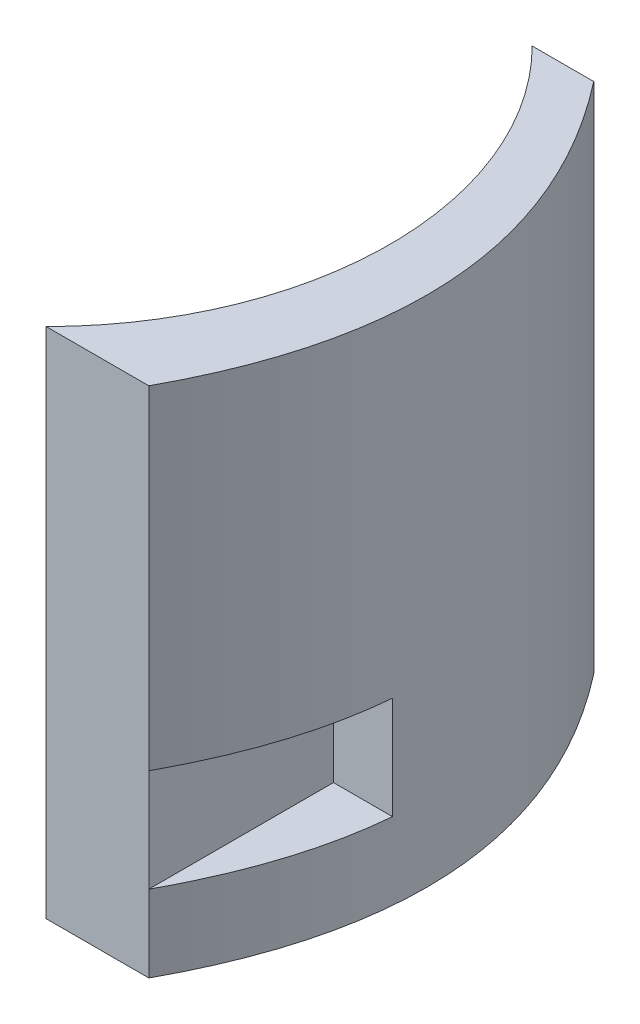
ISO-10303-21;
HEADER;
FILE_DESCRIPTION(('STEP AP214'),'2;1');
FILE_NAME('part.step','',(''),(''),'','','');
FILE_SCHEMA(('AUTOMOTIVE_DESIGN { 1 0 10303 214 1 1 1 1 }'));
ENDSEC;
DATA;
#1=APPLICATION_CONTEXT('core data for automotive mechanical design processes');
#2=APPLICATION_PROTOCOL_DEFINITION('international standard','automotive_design',2000,#1);
#3=PRODUCT_CONTEXT('',#1,'mechanical');
#4=PRODUCT('Part','Part','',(#3));
#5=PRODUCT_RELATED_PRODUCT_CATEGORY('part','',(#4));
#6=PRODUCT_DEFINITION_FORMATION('','',#4);
#7=PRODUCT_DEFINITION_CONTEXT('part definition',#1,'design');
#8=PRODUCT_DEFINITION('design','',#6,#7);
#9=PRODUCT_DEFINITION_SHAPE('','',#8);
#10=(LENGTH_UNIT() NAMED_UNIT(*) SI_UNIT(.MILLI.,.METRE.));
#11=(NAMED_UNIT(*) PLANE_ANGLE_UNIT() SI_UNIT($,.RADIAN.));
#12=(NAMED_UNIT(*) SI_UNIT($,.STERADIAN.) SOLID_ANGLE_UNIT());
#13=UNCERTAINTY_MEASURE_WITH_UNIT(LENGTH_MEASURE(1.E-05),#10,'distance_accuracy_value','');
#14=(GEOMETRIC_REPRESENTATION_CONTEXT(3) GLOBAL_UNCERTAINTY_ASSIGNED_CONTEXT((#13)) GLOBAL_UNIT_ASSIGNED_CONTEXT((#10,
#11,#12)) REPRESENTATION_CONTEXT('',''));
#15=CARTESIAN_POINT('',(0.,0.,0.));
#16=DIRECTION('',(0.,0.,1.));
#17=DIRECTION('',(1.,0.,0.));
#18=AXIS2_PLACEMENT_3D('',#15,#16,#17);
#19=CARTESIAN_POINT('',(29.6880771697493,50.,-23.6880771697493));
#20=CARTESIAN_POINT('',(47.2217353331707,50.,-1.18361385183467));
#21=CARTESIAN_POINT('',(33.6880771697493,50.,23.6880771697493));
#22=B_SPLINE_CURVE_WITH_KNOTS('',2,(#19,#20,#21),.UNSPECIFIED.,.F.,.F.,(3,3),(0.,1.),.UNSPECIFIED.);
#23=DIRECTION('',(0.,-1.,0.));
#24=VECTOR('',#23,1.);
#25=SURFACE_OF_LINEAR_EXTRUSION('',#22,#24);
#26=CARTESIAN_POINT('',(29.6880771697493,17.5,-23.6880771697493));
#27=CARTESIAN_POINT('',(47.2217353331707,17.5,-1.18361385183467));
#28=CARTESIAN_POINT('',(33.6880771697493,17.5,23.6880771697493));
#29=B_SPLINE_CURVE_WITH_KNOTS('',2,(#26,#27,#28),.UNSPECIFIED.,.F.,.F.,(3,3),(0.,1.),.UNSPECIFIED.);
#30=CARTESIAN_POINT('',(39.4429006357392,17.5,5.68807716974934));
#31=VERTEX_POINT('',#30);
#32=CARTESIAN_POINT('',(33.6880771697493,17.5,23.6880771697493));
#33=VERTEX_POINT('',#32);
#34=EDGE_CURVE('E11',#31,#33,#29,.T.);
#35=ORIENTED_EDGE('',*,*,#34,.F.);
#36=DIRECTION('',(0.,-1.,0.));
#37=VECTOR('',#36,1.);
#38=CARTESIAN_POINT('',(39.4429006357392,50.,5.68807716974933));
#39=LINE('',#38,#37);
#40=CARTESIAN_POINT('',(39.4429006357392,7.5,5.68807716974934));
#41=VERTEX_POINT('',#40);
#42=EDGE_CURVE('E192',#41,#31,#39,.F.);
#43=ORIENTED_EDGE('',*,*,#42,.F.);
#44=CARTESIAN_POINT('',(29.6880771697493,7.5,-23.6880771697493));
#45=CARTESIAN_POINT('',(47.2217353331707,7.5,-1.18361385183467));
#46=CARTESIAN_POINT('',(33.6880771697493,7.5,23.6880771697493));
#47=B_SPLINE_CURVE_WITH_KNOTS('',2,(#44,#45,#46),.UNSPECIFIED.,.F.,.F.,(3,3),(0.,1.),.UNSPECIFIED.);
#48=CARTESIAN_POINT('',(33.6880771697493,7.5,23.6880771697493));
#49=VERTEX_POINT('',#48);
#50=EDGE_CURVE('E54',#49,#41,#47,.F.);
#51=ORIENTED_EDGE('',*,*,#50,.F.);
#52=DIRECTION('',(0.,-1.,0.));
#53=VECTOR('',#52,1.);
#54=CARTESIAN_POINT('',(33.6880771697493,50.,23.6880771697493));
#55=LINE('',#54,#53);
#56=CARTESIAN_POINT('',(33.6880771697493,0.,23.6880771697493));
#57=VERTEX_POINT('',#56);
#58=EDGE_CURVE('E92',#49,#57,#55,.T.);
#59=ORIENTED_EDGE('',*,*,#58,.T.);
#60=CARTESIAN_POINT('',(29.6880771697493,0.,-23.6880771697493));
#61=CARTESIAN_POINT('',(47.2217353331707,0.,-1.18361385183467));
#62=CARTESIAN_POINT('',(33.6880771697493,0.,23.6880771697493));
#63=B_SPLINE_CURVE_WITH_KNOTS('',2,(#60,#61,#62),.UNSPECIFIED.,.F.,.F.,(3,3),(0.,1.),.UNSPECIFIED.);
#64=CARTESIAN_POINT('',(29.6880771697493,0.,-23.6880771697493));
#65=VERTEX_POINT('',#64);
#66=EDGE_CURVE('E141',#65,#57,#63,.T.);
#67=ORIENTED_EDGE('',*,*,#66,.F.);
#68=DIRECTION('',(0.,-1.,0.));
#69=VECTOR('',#68,1.);
#70=CARTESIAN_POINT('',(29.6880771697493,50.,-23.6880771697493));
#71=LINE('',#70,#69);
#72=CARTESIAN_POINT('',(29.6880771697493,50.,-23.6880771697493));
#73=VERTEX_POINT('',#72);
#74=EDGE_CURVE('E97',#73,#65,#71,.T.);
#75=ORIENTED_EDGE('',*,*,#74,.F.);
#76=CARTESIAN_POINT('',(33.6880771697493,50.,23.6880771697493));
#77=VERTEX_POINT('',#76);
#78=EDGE_CURVE('E142',#73,#77,#22,.T.);
#79=ORIENTED_EDGE('',*,*,#78,.T.);
#80=EDGE_CURVE('E180',#77,#33,#55,.T.);
#81=ORIENTED_EDGE('',*,*,#80,.T.);
#82=EDGE_LOOP('',(#35,#43,#51,#59,#67,#75,#79,#81));
#83=FACE_BOUND('',#82,.T.);
#84=ADVANCED_FACE('F43',(#83),#25,.T.);
#85=CARTESIAN_POINT('',(0.,50.,-23.6880771697493));
#86=DIRECTION('',(0.,0.,-1.));
#87=DIRECTION('',(-1.,0.,0.));
#88=AXIS2_PLACEMENT_3D('',#85,#86,#87);
#89=PLANE('',#88);
#90=DIRECTION('',(1.,0.,0.));
#91=VECTOR('',#90,1.);
#92=CARTESIAN_POINT('',(0.,0.,-23.6880771697493));
#93=LINE('',#92,#91);
#94=CARTESIAN_POINT('',(23.6880771697493,0.,-23.6880771697493));
#95=VERTEX_POINT('',#94);
#96=EDGE_CURVE('E167',#95,#65,#93,.T.);
#97=ORIENTED_EDGE('',*,*,#96,.F.);
#98=DIRECTION('',(0.,-1.,0.));
#99=VECTOR('',#98,1.);
#100=CARTESIAN_POINT('',(23.6880771697493,50.,-23.6880771697493));
#101=LINE('',#100,#99);
#102=CARTESIAN_POINT('',(23.6880771697493,50.,-23.6880771697493));
#103=VERTEX_POINT('',#102);
#104=EDGE_CURVE('E187',#103,#95,#101,.T.);
#105=ORIENTED_EDGE('',*,*,#104,.F.);
#106=DIRECTION('',(1.,0.,0.));
#107=VECTOR('',#106,1.);
#108=CARTESIAN_POINT('',(0.,50.,-23.6880771697493));
#109=LINE('',#108,#107);
#110=EDGE_CURVE('E148',#103,#73,#109,.T.);
#111=ORIENTED_EDGE('',*,*,#110,.T.);
#112=ORIENTED_EDGE('',*,*,#74,.T.);
#113=EDGE_LOOP('',(#97,#105,#111,#112));
#114=FACE_BOUND('',#113,.T.);
#115=ADVANCED_FACE('F212',(#114),#89,.T.);
#116=CARTESIAN_POINT('',(0.,50.,0.));
#117=DIRECTION('',(0.,-1.,0.));
#118=DIRECTION('',(0.,0.,-1.));
#119=AXIS2_PLACEMENT_3D('',#116,#117,#118);
#120=CYLINDRICAL_SURFACE('',#119,33.5);
#121=CARTESIAN_POINT('',(0.,0.,0.));
#122=DIRECTION('',(0.,1.,0.));
#123=DIRECTION('',(0.,0.,1.));
#124=AXIS2_PLACEMENT_3D('',#121,#122,#123);
#125=CIRCLE('',#124,33.5);
#126=CARTESIAN_POINT('',(23.6880771697493,0.,23.6880771697493));
#127=VERTEX_POINT('',#126);
#128=EDGE_CURVE('E174',#127,#95,#125,.T.);
#129=ORIENTED_EDGE('',*,*,#128,.F.);
#130=DIRECTION('',(0.,-1.,0.));
#131=VECTOR('',#130,1.);
#132=CARTESIAN_POINT('',(23.6880771697493,50.,23.6880771697493));
#133=LINE('',#132,#131);
#134=CARTESIAN_POINT('',(23.6880771697493,50.,23.6880771697493));
#135=VERTEX_POINT('',#134);
#136=EDGE_CURVE('E184',#135,#127,#133,.T.);
#137=ORIENTED_EDGE('',*,*,#136,.F.);
#138=CARTESIAN_POINT('',(0.,50.,0.));
#139=DIRECTION('',(0.,1.,0.));
#140=DIRECTION('',(0.,0.,1.));
#141=AXIS2_PLACEMENT_3D('',#138,#139,#140);
#142=CIRCLE('',#141,33.5);
#143=EDGE_CURVE('E156',#135,#103,#142,.T.);
#144=ORIENTED_EDGE('',*,*,#143,.T.);
#145=ORIENTED_EDGE('',*,*,#104,.T.);
#146=EDGE_LOOP('',(#129,#137,#144,#145));
#147=FACE_BOUND('',#146,.T.);
#148=ADVANCED_FACE('F216',(#147),#120,.F.);
#149=CARTESIAN_POINT('',(0.,50.,23.6880771697493));
#150=DIRECTION('',(0.,0.,-1.));
#151=DIRECTION('',(-1.,0.,0.));
#152=AXIS2_PLACEMENT_3D('',#149,#150,#151);
#153=PLANE('',#152);
#154=DIRECTION('',(1.,0.,0.));
#155=VECTOR('',#154,1.);
#156=CARTESIAN_POINT('',(0.,0.,23.6880771697493));
#157=LINE('',#156,#155);
#158=EDGE_CURVE('E149',#127,#57,#157,.T.);
#159=ORIENTED_EDGE('',*,*,#158,.T.);
#160=ORIENTED_EDGE('',*,*,#58,.F.);
#161=DIRECTION('',(0.,-1.,0.));
#162=VECTOR('',#161,1.);
#163=CARTESIAN_POINT('',(33.6880771697493,7.5,23.6880771697493));
#164=LINE('',#163,#162);
#165=EDGE_CURVE('E119',#33,#49,#164,.T.);
#166=ORIENTED_EDGE('',*,*,#165,.F.);
#167=ORIENTED_EDGE('',*,*,#80,.F.);
#168=DIRECTION('',(1.,0.,0.));
#169=VECTOR('',#168,1.);
#170=CARTESIAN_POINT('',(0.,50.,23.6880771697493));
#171=LINE('',#170,#169);
#172=EDGE_CURVE('E69',#135,#77,#171,.T.);
#173=ORIENTED_EDGE('',*,*,#172,.F.);
#174=ORIENTED_EDGE('',*,*,#136,.T.);
#175=EDGE_LOOP('',(#159,#160,#166,#167,#173,#174));
#176=FACE_BOUND('',#175,.T.);
#177=ADVANCED_FACE('F205',(#176),#153,.F.);
#178=CARTESIAN_POINT('',(0.,50.,0.));
#179=DIRECTION('',(0.,1.,0.));
#180=DIRECTION('',(0.,0.,1.));
#181=AXIS2_PLACEMENT_3D('',#178,#179,#180);
#182=PLANE('',#181);
#183=ORIENTED_EDGE('',*,*,#78,.F.);
#184=ORIENTED_EDGE('',*,*,#110,.F.);
#185=ORIENTED_EDGE('',*,*,#143,.F.);
#186=ORIENTED_EDGE('',*,*,#172,.T.);
#187=EDGE_LOOP('',(#183,#184,#185,#186));
#188=FACE_BOUND('',#187,.T.);
#189=ADVANCED_FACE('F214',(#188),#182,.T.);
#190=CARTESIAN_POINT('',(0.,0.,0.));
#191=DIRECTION('',(0.,1.,0.));
#192=DIRECTION('',(0.,0.,1.));
#193=AXIS2_PLACEMENT_3D('',#190,#191,#192);
#194=PLANE('',#193);
#195=ORIENTED_EDGE('',*,*,#66,.T.);
#196=ORIENTED_EDGE('',*,*,#158,.F.);
#197=ORIENTED_EDGE('',*,*,#128,.T.);
#198=ORIENTED_EDGE('',*,*,#96,.T.);
#199=EDGE_LOOP('',(#195,#196,#197,#198));
#200=FACE_BOUND('',#199,.T.);
#201=ADVANCED_FACE('F209',(#200),#194,.F.);
#202=CARTESIAN_POINT('',(33.6880771697493,7.5,5.68807716974934));
#203=DIRECTION('',(-1.,0.,0.));
#204=DIRECTION('',(0.,0.,1.));
#205=AXIS2_PLACEMENT_3D('',#202,#203,#204);
#206=PLANE('',#205);
#207=ORIENTED_EDGE('',*,*,#165,.T.);
#208=DIRECTION('',(0.,0.,1.));
#209=VECTOR('',#208,1.);
#210=CARTESIAN_POINT('',(33.6880771697493,7.5,5.68807716974934));
#211=LINE('',#210,#209);
#212=CARTESIAN_POINT('',(33.6880771697493,7.5,5.68807716974934));
#213=VERTEX_POINT('',#212);
#214=EDGE_CURVE('E113',#213,#49,#211,.T.);
#215=ORIENTED_EDGE('',*,*,#214,.F.);
#216=DIRECTION('',(0.,-1.,0.));
#217=VECTOR('',#216,1.);
#218=CARTESIAN_POINT('',(33.6880771697493,7.5,5.68807716974934));
#219=LINE('',#218,#217);
#220=CARTESIAN_POINT('',(33.6880771697493,17.5,5.68807716974934));
#221=VERTEX_POINT('',#220);
#222=EDGE_CURVE('E117',#221,#213,#219,.T.);
#223=ORIENTED_EDGE('',*,*,#222,.F.);
#224=DIRECTION('',(0.,0.,1.));
#225=VECTOR('',#224,1.);
#226=CARTESIAN_POINT('',(33.6880771697493,17.5,5.68807716974934));
#227=LINE('',#226,#225);
#228=EDGE_CURVE('E61',#221,#33,#227,.T.);
#229=ORIENTED_EDGE('',*,*,#228,.T.);
#230=EDGE_LOOP('',(#207,#215,#223,#229));
#231=FACE_BOUND('',#230,.T.);
#232=ADVANCED_FACE('F115',(#231),#206,.F.);
#233=CARTESIAN_POINT('',(33.6880771697493,17.5,5.68807716974934));
#234=DIRECTION('',(0.,1.,0.));
#235=DIRECTION('',(0.,0.,1.));
#236=AXIS2_PLACEMENT_3D('',#233,#234,#235);
#237=PLANE('',#236);
#238=ORIENTED_EDGE('',*,*,#34,.T.);
#239=ORIENTED_EDGE('',*,*,#228,.F.);
#240=DIRECTION('',(-1.,0.,0.));
#241=VECTOR('',#240,1.);
#242=CARTESIAN_POINT('',(33.6880771697493,17.5,5.68807716974934));
#243=LINE('',#242,#241);
#244=EDGE_CURVE('E122',#31,#221,#243,.T.);
#245=ORIENTED_EDGE('',*,*,#244,.F.);
#246=EDGE_LOOP('',(#238,#239,#245));
#247=FACE_BOUND('',#246,.T.);
#248=ADVANCED_FACE('F203',(#247),#237,.F.);
#249=CARTESIAN_POINT('',(33.6880771697493,7.5,5.68807716974934));
#250=DIRECTION('',(0.,-1.,0.));
#251=DIRECTION('',(0.,0.,-1.));
#252=AXIS2_PLACEMENT_3D('',#249,#250,#251);
#253=PLANE('',#252);
#254=ORIENTED_EDGE('',*,*,#50,.T.);
#255=DIRECTION('',(1.,0.,0.));
#256=VECTOR('',#255,1.);
#257=CARTESIAN_POINT('',(33.6880771697493,7.5,5.68807716974934));
#258=LINE('',#257,#256);
#259=EDGE_CURVE('E125',#213,#41,#258,.T.);
#260=ORIENTED_EDGE('',*,*,#259,.F.);
#261=ORIENTED_EDGE('',*,*,#214,.T.);
#262=EDGE_LOOP('',(#254,#260,#261));
#263=FACE_BOUND('',#262,.T.);
#264=ADVANCED_FACE('F126',(#263),#253,.F.);
#265=CARTESIAN_POINT('',(0.,0.,5.68807716974934));
#266=DIRECTION('',(0.,0.,-1.));
#267=DIRECTION('',(-1.,0.,0.));
#268=AXIS2_PLACEMENT_3D('',#265,#266,#267);
#269=PLANE('',#268);
#270=ORIENTED_EDGE('',*,*,#42,.T.);
#271=ORIENTED_EDGE('',*,*,#244,.T.);
#272=ORIENTED_EDGE('',*,*,#222,.T.);
#273=ORIENTED_EDGE('',*,*,#259,.T.);
#274=EDGE_LOOP('',(#270,#271,#272,#273));
#275=FACE_BOUND('',#274,.T.);
#276=ADVANCED_FACE('F131',(#275),#269,.F.);
#277=CLOSED_SHELL('',(#84,#115,#148,#177,#189,#201,#232,#248,#264,#276));
#278=MANIFOLD_SOLID_BREP('B2',#277);
#279=ADVANCED_BREP_SHAPE_REPRESENTATION('',(#18,#278),#14);
#280=SHAPE_DEFINITION_REPRESENTATION(#9,#279);
ENDSEC;
END-ISO-10303-21;
